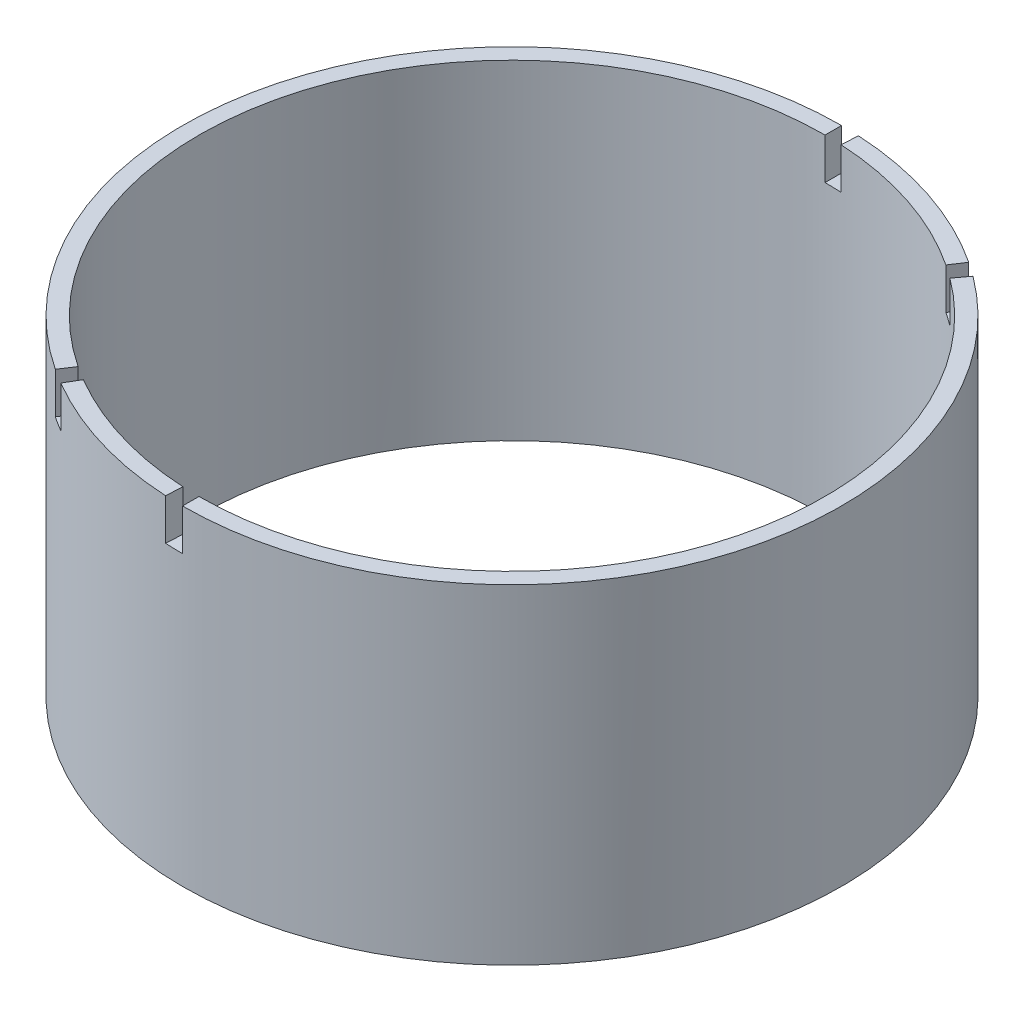
ISO-10303-21;
HEADER;
FILE_DESCRIPTION(('STEP AP214'),'2;1');
FILE_NAME('part.step','',(''),(''),'','','');
FILE_SCHEMA(('AUTOMOTIVE_DESIGN { 1 0 10303 214 1 1 1 1 }'));
ENDSEC;
DATA;
#1=APPLICATION_CONTEXT('core data for automotive mechanical design processes');
#2=APPLICATION_PROTOCOL_DEFINITION('international standard','automotive_design',2000,#1);
#3=PRODUCT_CONTEXT('',#1,'mechanical');
#4=PRODUCT('Part','Part','',(#3));
#5=PRODUCT_RELATED_PRODUCT_CATEGORY('part','',(#4));
#6=PRODUCT_DEFINITION_FORMATION('','',#4);
#7=PRODUCT_DEFINITION_CONTEXT('part definition',#1,'design');
#8=PRODUCT_DEFINITION('design','',#6,#7);
#9=PRODUCT_DEFINITION_SHAPE('','',#8);
#10=(LENGTH_UNIT() NAMED_UNIT(*) SI_UNIT(.MILLI.,.METRE.));
#11=(NAMED_UNIT(*) PLANE_ANGLE_UNIT() SI_UNIT($,.RADIAN.));
#12=(NAMED_UNIT(*) SI_UNIT($,.STERADIAN.) SOLID_ANGLE_UNIT());
#13=UNCERTAINTY_MEASURE_WITH_UNIT(LENGTH_MEASURE(1.E-05),#10,'distance_accuracy_value','');
#14=(GEOMETRIC_REPRESENTATION_CONTEXT(3) GLOBAL_UNCERTAINTY_ASSIGNED_CONTEXT((#13)) GLOBAL_UNIT_ASSIGNED_CONTEXT((#10,
#11,#12)) REPRESENTATION_CONTEXT('',''));
#15=CARTESIAN_POINT('',(0.,0.,0.));
#16=DIRECTION('',(0.,0.,1.));
#17=DIRECTION('',(1.,0.,0.));
#18=AXIS2_PLACEMENT_3D('',#15,#16,#17);
#19=CARTESIAN_POINT('',(0.,40.,0.));
#20=DIRECTION('',(0.,1.,0.));
#21=DIRECTION('',(0.,0.,1.));
#22=AXIS2_PLACEMENT_3D('',#19,#20,#21);
#23=PLANE('',#22);
#24=DIRECTION('',(-0.552402743706876,0.,0.833577356185445));
#25=VECTOR('',#24,1.);
#26=CARTESIAN_POINT('',(-22.096109748275,40.,33.3430942474178));
#27=LINE('',#26,#25);
#28=CARTESIAN_POINT('',(-20.9913042608613,40.,31.6759395350469));
#29=VERTEX_POINT('',#28);
#30=CARTESIAN_POINT('',(-22.096109748275,40.,33.3430942474178));
#31=VERTEX_POINT('',#30);
#32=EDGE_CURVE('E161',#29,#31,#27,.T.);
#33=ORIENTED_EDGE('',*,*,#32,.F.);
#34=CARTESIAN_POINT('',(0.,40.,0.));
#35=DIRECTION('',(0.,1.,0.));
#36=DIRECTION('',(0.,0.,1.));
#37=AXIS2_PLACEMENT_3D('',#34,#35,#36);
#38=CIRCLE('',#37,38.);
#39=CARTESIAN_POINT('',(0.,40.,-38.));
#40=VERTEX_POINT('',#39);
#41=EDGE_CURVE('E247',#40,#29,#38,.T.);
#42=ORIENTED_EDGE('',*,*,#41,.F.);
#43=DIRECTION('',(0.,0.,1.));
#44=VECTOR('',#43,1.);
#45=CARTESIAN_POINT('',(0.,40.,-40.));
#46=LINE('',#45,#44);
#47=CARTESIAN_POINT('',(0.,40.,-40.));
#48=VERTEX_POINT('',#47);
#49=EDGE_CURVE('E213',#48,#40,#46,.T.);
#50=ORIENTED_EDGE('',*,*,#49,.F.);
#51=CARTESIAN_POINT('',(0.,40.,0.));
#52=DIRECTION('',(0.,1.,0.));
#53=DIRECTION('',(0.,0.,1.));
#54=AXIS2_PLACEMENT_3D('',#51,#52,#53);
#55=CIRCLE('',#54,40.);
#56=EDGE_CURVE('E11',#48,#31,#55,.T.);
#57=ORIENTED_EDGE('',*,*,#56,.T.);
#58=EDGE_LOOP('',(#33,#42,#50,#57));
#59=FACE_BOUND('',#58,.T.);
#60=ADVANCED_FACE('F31',(#59),#23,.T.);
#61=DIRECTION('',(0.595494941447405,0.,-0.803359057153495));
#62=VECTOR('',#61,1.);
#63=CARTESIAN_POINT('',(23.8197976578962,40.,-32.1343622861398));
#64=LINE('',#63,#62);
#65=CARTESIAN_POINT('',(22.6288077750014,40.,-30.5276441718328));
#66=VERTEX_POINT('',#65);
#67=CARTESIAN_POINT('',(23.8197976578962,40.,-32.1343622861398));
#68=VERTEX_POINT('',#67);
#69=EDGE_CURVE('E174',#66,#68,#64,.T.);
#70=ORIENTED_EDGE('',*,*,#69,.F.);
#71=CARTESIAN_POINT('',(0.,40.,38.));
#72=VERTEX_POINT('',#71);
#73=EDGE_CURVE('E251',#72,#66,#38,.T.);
#74=ORIENTED_EDGE('',*,*,#73,.F.);
#75=DIRECTION('',(0.,0.,-1.));
#76=VECTOR('',#75,1.);
#77=CARTESIAN_POINT('',(0.,40.,40.));
#78=LINE('',#77,#76);
#79=CARTESIAN_POINT('',(0.,40.,40.));
#80=VERTEX_POINT('',#79);
#81=EDGE_CURVE('E189',#80,#72,#78,.T.);
#82=ORIENTED_EDGE('',*,*,#81,.F.);
#83=EDGE_CURVE('E41',#80,#68,#55,.T.);
#84=ORIENTED_EDGE('',*,*,#83,.T.);
#85=EDGE_LOOP('',(#70,#74,#82,#84));
#86=FACE_BOUND('',#85,.T.);
#87=ADVANCED_FACE('F291',(#86),#23,.T.);
#88=DIRECTION('',(0.50778034446023,0.,-0.861486576668406));
#89=VECTOR('',#88,1.);
#90=CARTESIAN_POINT('',(-20.3112137784094,40.,34.4594630667362));
#91=LINE('',#90,#89);
#92=CARTESIAN_POINT('',(-20.3112137784094,40.,34.4594630667362));
#93=VERTEX_POINT('',#92);
#94=CARTESIAN_POINT('',(-19.2956530894889,40.,32.7364899133993));
#95=VERTEX_POINT('',#94);
#96=EDGE_CURVE('E272',#93,#95,#91,.T.);
#97=ORIENTED_EDGE('',*,*,#96,.F.);
#98=CARTESIAN_POINT('',(-2.10526315789474,40.,39.9445599179164));
#99=VERTEX_POINT('',#98);
#100=EDGE_CURVE('E40',#93,#99,#55,.T.);
#101=ORIENTED_EDGE('',*,*,#100,.T.);
#102=DIRECTION('',(-0.0526315789473712,0.,0.998613997947909));
#103=VECTOR('',#102,1.);
#104=CARTESIAN_POINT('',(-2.10526315789474,40.,39.9445599179164));
#105=LINE('',#104,#103);
#106=CARTESIAN_POINT('',(-2.,40.,37.9473319220206));
#107=VERTEX_POINT('',#106);
#108=EDGE_CURVE('E200',#107,#99,#105,.T.);
#109=ORIENTED_EDGE('',*,*,#108,.F.);
#110=EDGE_CURVE('E250',#95,#107,#38,.T.);
#111=ORIENTED_EDGE('',*,*,#110,.F.);
#112=EDGE_LOOP('',(#97,#101,#109,#111));
#113=FACE_BOUND('',#112,.T.);
#114=ADVANCED_FACE('F271',(#113),#23,.T.);
#115=DIRECTION('',(-0.552402743706877,0.,0.833577356185444));
#116=VECTOR('',#115,1.);
#117=CARTESIAN_POINT('',(22.0961097482751,40.,-33.3430942474178));
#118=LINE('',#117,#116);
#119=CARTESIAN_POINT('',(22.0961097482751,40.,-33.3430942474178));
#120=VERTEX_POINT('',#119);
#121=CARTESIAN_POINT('',(20.9913042608613,40.,-31.6759395350469));
#122=VERTEX_POINT('',#121);
#123=EDGE_CURVE('E182',#120,#122,#118,.T.);
#124=ORIENTED_EDGE('',*,*,#123,.F.);
#125=CARTESIAN_POINT('',(2.10526315789473,40.,-39.9445599179164));
#126=VERTEX_POINT('',#125);
#127=EDGE_CURVE('E273',#120,#126,#55,.T.);
#128=ORIENTED_EDGE('',*,*,#127,.T.);
#129=DIRECTION('',(0.0526315789473683,0.,-0.998613997947909));
#130=VECTOR('',#129,1.);
#131=CARTESIAN_POINT('',(2.10526315789473,40.,-39.9445599179164));
#132=LINE('',#131,#130);
#133=CARTESIAN_POINT('',(2.,40.,-37.9473319220206));
#134=VERTEX_POINT('',#133);
#135=EDGE_CURVE('E225',#134,#126,#132,.T.);
#136=ORIENTED_EDGE('',*,*,#135,.F.);
#137=EDGE_CURVE('E253',#122,#134,#38,.T.);
#138=ORIENTED_EDGE('',*,*,#137,.F.);
#139=EDGE_LOOP('',(#124,#128,#136,#138));
#140=FACE_BOUND('',#139,.T.);
#141=ADVANCED_FACE('F284',(#140),#23,.T.);
#142=CARTESIAN_POINT('',(0.,0.,0.));
#143=DIRECTION('',(0.,1.,0.));
#144=DIRECTION('',(0.,0.,1.));
#145=AXIS2_PLACEMENT_3D('',#142,#143,#144);
#146=PLANE('',#145);
#147=CARTESIAN_POINT('',(0.,0.,0.));
#148=DIRECTION('',(0.,1.,0.));
#149=DIRECTION('',(0.,0.,1.));
#150=AXIS2_PLACEMENT_3D('',#147,#148,#149);
#151=CIRCLE('',#150,40.);
#152=CARTESIAN_POINT('',(0.,0.,40.));
#153=VERTEX_POINT('',#152);
#154=EDGE_CURVE('E35',#153,#153,#151,.T.);
#155=ORIENTED_EDGE('',*,*,#154,.F.);
#156=EDGE_LOOP('',(#155));
#157=FACE_BOUND('',#156,.T.);
#158=CARTESIAN_POINT('',(0.,0.,0.));
#159=DIRECTION('',(0.,1.,0.));
#160=DIRECTION('',(0.,0.,1.));
#161=AXIS2_PLACEMENT_3D('',#158,#159,#160);
#162=CIRCLE('',#161,38.);
#163=CARTESIAN_POINT('',(0.,0.,38.));
#164=VERTEX_POINT('',#163);
#165=EDGE_CURVE('E239',#164,#164,#162,.T.);
#166=ORIENTED_EDGE('',*,*,#165,.T.);
#167=EDGE_LOOP('',(#166));
#168=FACE_BOUND('',#167,.T.);
#169=ADVANCED_FACE('F282',(#157,#168),#146,.F.);
#170=CARTESIAN_POINT('',(0.,40.,0.));
#171=DIRECTION('',(0.,-1.,0.));
#172=DIRECTION('',(0.,0.,-1.));
#173=AXIS2_PLACEMENT_3D('',#170,#171,#172);
#174=CYLINDRICAL_SURFACE('',#173,40.);
#175=CARTESIAN_POINT('',(0.,35.,0.));
#176=DIRECTION('',(0.,1.,0.));
#177=DIRECTION('',(0.,0.,-1.));
#178=AXIS2_PLACEMENT_3D('',#175,#176,#177);
#179=CIRCLE('',#178,40.);
#180=CARTESIAN_POINT('',(-22.096109748275,35.,33.3430942474178));
#181=VERTEX_POINT('',#180);
#182=CARTESIAN_POINT('',(-20.3112137784094,35.,34.4594630667362));
#183=VERTEX_POINT('',#182);
#184=EDGE_CURVE('E152',#181,#183,#179,.T.);
#185=ORIENTED_EDGE('',*,*,#184,.F.);
#186=DIRECTION('',(0.,1.,0.));
#187=VECTOR('',#186,1.);
#188=CARTESIAN_POINT('',(-22.096109748275,35.,33.3430942474178));
#189=LINE('',#188,#187);
#190=EDGE_CURVE('E184',#181,#31,#189,.T.);
#191=ORIENTED_EDGE('',*,*,#190,.T.);
#192=ORIENTED_EDGE('',*,*,#56,.F.);
#193=DIRECTION('',(0.,1.,0.));
#194=VECTOR('',#193,1.);
#195=CARTESIAN_POINT('',(0.,35.,-40.));
#196=LINE('',#195,#194);
#197=CARTESIAN_POINT('',(0.,35.,-40.));
#198=VERTEX_POINT('',#197);
#199=EDGE_CURVE('E232',#198,#48,#196,.T.);
#200=ORIENTED_EDGE('',*,*,#199,.F.);
#201=CARTESIAN_POINT('',(0.,35.,0.));
#202=DIRECTION('',(0.,1.,0.));
#203=DIRECTION('',(0.,0.,-1.));
#204=AXIS2_PLACEMENT_3D('',#201,#202,#203);
#205=CIRCLE('',#204,40.);
#206=CARTESIAN_POINT('',(2.10526315789473,35.,-39.9445599179164));
#207=VERTEX_POINT('',#206);
#208=EDGE_CURVE('E221',#207,#198,#205,.T.);
#209=ORIENTED_EDGE('',*,*,#208,.F.);
#210=DIRECTION('',(0.,1.,0.));
#211=VECTOR('',#210,1.);
#212=CARTESIAN_POINT('',(2.10526315789473,35.,-39.9445599179164));
#213=LINE('',#212,#211);
#214=EDGE_CURVE('E236',#207,#126,#213,.T.);
#215=ORIENTED_EDGE('',*,*,#214,.T.);
#216=ORIENTED_EDGE('',*,*,#127,.F.);
#217=DIRECTION('',(0.,1.,0.));
#218=VECTOR('',#217,1.);
#219=CARTESIAN_POINT('',(22.0961097482751,35.,-33.3430942474178));
#220=LINE('',#219,#218);
#221=CARTESIAN_POINT('',(22.0961097482751,35.,-33.3430942474178));
#222=VERTEX_POINT('',#221);
#223=EDGE_CURVE('E181',#222,#120,#220,.T.);
#224=ORIENTED_EDGE('',*,*,#223,.F.);
#225=CARTESIAN_POINT('',(0.,35.,0.));
#226=DIRECTION('',(0.,1.,0.));
#227=DIRECTION('',(0.,0.,-1.));
#228=AXIS2_PLACEMENT_3D('',#225,#226,#227);
#229=CIRCLE('',#228,40.);
#230=CARTESIAN_POINT('',(23.8197976578962,35.,-32.1343622861398));
#231=VERTEX_POINT('',#230);
#232=EDGE_CURVE('E172',#231,#222,#229,.T.);
#233=ORIENTED_EDGE('',*,*,#232,.F.);
#234=DIRECTION('',(0.,1.,0.));
#235=VECTOR('',#234,1.);
#236=CARTESIAN_POINT('',(23.8197976578962,35.,-32.1343622861398));
#237=LINE('',#236,#235);
#238=EDGE_CURVE('E186',#231,#68,#237,.T.);
#239=ORIENTED_EDGE('',*,*,#238,.T.);
#240=ORIENTED_EDGE('',*,*,#83,.F.);
#241=DIRECTION('',(0.,1.,0.));
#242=VECTOR('',#241,1.);
#243=CARTESIAN_POINT('',(0.,35.,40.));
#244=LINE('',#243,#242);
#245=CARTESIAN_POINT('',(0.,35.,40.));
#246=VERTEX_POINT('',#245);
#247=EDGE_CURVE('E207',#246,#80,#244,.T.);
#248=ORIENTED_EDGE('',*,*,#247,.F.);
#249=CARTESIAN_POINT('',(0.,35.,0.));
#250=DIRECTION('',(0.,1.,0.));
#251=DIRECTION('',(0.,0.,1.));
#252=AXIS2_PLACEMENT_3D('',#249,#250,#251);
#253=CIRCLE('',#252,40.);
#254=CARTESIAN_POINT('',(-2.10526315789474,35.,39.9445599179164));
#255=VERTEX_POINT('',#254);
#256=EDGE_CURVE('E196',#255,#246,#253,.T.);
#257=ORIENTED_EDGE('',*,*,#256,.F.);
#258=DIRECTION('',(0.,1.,0.));
#259=VECTOR('',#258,1.);
#260=CARTESIAN_POINT('',(-2.10526315789474,35.,39.9445599179164));
#261=LINE('',#260,#259);
#262=EDGE_CURVE('E211',#255,#99,#261,.T.);
#263=ORIENTED_EDGE('',*,*,#262,.T.);
#264=ORIENTED_EDGE('',*,*,#100,.F.);
#265=DIRECTION('',(0.,1.,0.));
#266=VECTOR('',#265,1.);
#267=CARTESIAN_POINT('',(-20.3112137784094,35.,34.4594630667362));
#268=LINE('',#267,#266);
#269=EDGE_CURVE('E146',#183,#93,#268,.T.);
#270=ORIENTED_EDGE('',*,*,#269,.F.);
#271=EDGE_LOOP('',(#185,#191,#192,#200,#209,#215,#216,#224,#233,#239,#240,#248,#257,#263,#264,#270));
#272=FACE_BOUND('',#271,.T.);
#273=ORIENTED_EDGE('',*,*,#154,.T.);
#274=EDGE_LOOP('',(#273));
#275=FACE_BOUND('',#274,.T.);
#276=ADVANCED_FACE('F33',(#272,#275),#174,.T.);
#277=CARTESIAN_POINT('',(0.,40.,0.));
#278=DIRECTION('',(0.,-1.,0.));
#279=DIRECTION('',(0.,0.,-1.));
#280=AXIS2_PLACEMENT_3D('',#277,#278,#279);
#281=CYLINDRICAL_SURFACE('',#280,38.);
#282=DIRECTION('',(0.,1.,0.));
#283=VECTOR('',#282,1.);
#284=CARTESIAN_POINT('',(-20.9913042608613,35.,31.6759395350469));
#285=LINE('',#284,#283);
#286=CARTESIAN_POINT('',(-20.9913042608613,35.,31.6759395350469));
#287=VERTEX_POINT('',#286);
#288=EDGE_CURVE('E167',#287,#29,#285,.T.);
#289=ORIENTED_EDGE('',*,*,#288,.F.);
#290=CARTESIAN_POINT('',(0.,35.,0.));
#291=DIRECTION('',(0.,-1.,0.));
#292=DIRECTION('',(0.,0.,-1.));
#293=AXIS2_PLACEMENT_3D('',#290,#291,#292);
#294=CIRCLE('',#293,38.);
#295=CARTESIAN_POINT('',(-19.2956530894889,35.,32.7364899133993));
#296=VERTEX_POINT('',#295);
#297=EDGE_CURVE('E151',#296,#287,#294,.T.);
#298=ORIENTED_EDGE('',*,*,#297,.F.);
#299=DIRECTION('',(0.,1.,0.));
#300=VECTOR('',#299,1.);
#301=CARTESIAN_POINT('',(-19.2956530894889,35.,32.7364899133993));
#302=LINE('',#301,#300);
#303=EDGE_CURVE('E149',#296,#95,#302,.T.);
#304=ORIENTED_EDGE('',*,*,#303,.T.);
#305=ORIENTED_EDGE('',*,*,#110,.T.);
#306=DIRECTION('',(0.,1.,0.));
#307=VECTOR('',#306,1.);
#308=CARTESIAN_POINT('',(-2.,35.,37.9473319220206));
#309=LINE('',#308,#307);
#310=CARTESIAN_POINT('',(-2.,35.,37.9473319220206));
#311=VERTEX_POINT('',#310);
#312=EDGE_CURVE('E214',#311,#107,#309,.T.);
#313=ORIENTED_EDGE('',*,*,#312,.F.);
#314=CARTESIAN_POINT('',(0.,35.,0.));
#315=DIRECTION('',(0.,-1.,0.));
#316=DIRECTION('',(0.,0.,1.));
#317=AXIS2_PLACEMENT_3D('',#314,#315,#316);
#318=CIRCLE('',#317,38.);
#319=CARTESIAN_POINT('',(0.,35.,38.));
#320=VERTEX_POINT('',#319);
#321=EDGE_CURVE('E202',#320,#311,#318,.T.);
#322=ORIENTED_EDGE('',*,*,#321,.F.);
#323=DIRECTION('',(0.,1.,0.));
#324=VECTOR('',#323,1.);
#325=CARTESIAN_POINT('',(0.,35.,38.));
#326=LINE('',#325,#324);
#327=EDGE_CURVE('E217',#320,#72,#326,.T.);
#328=ORIENTED_EDGE('',*,*,#327,.T.);
#329=ORIENTED_EDGE('',*,*,#73,.T.);
#330=DIRECTION('',(0.,1.,0.));
#331=VECTOR('',#330,1.);
#332=CARTESIAN_POINT('',(22.6288077750014,35.,-30.5276441718328));
#333=LINE('',#332,#331);
#334=CARTESIAN_POINT('',(22.6288077750014,35.,-30.5276441718328));
#335=VERTEX_POINT('',#334);
#336=EDGE_CURVE('E190',#335,#66,#333,.T.);
#337=ORIENTED_EDGE('',*,*,#336,.F.);
#338=CARTESIAN_POINT('',(0.,35.,0.));
#339=DIRECTION('',(0.,-1.,0.));
#340=DIRECTION('',(0.,0.,-1.));
#341=AXIS2_PLACEMENT_3D('',#338,#339,#340);
#342=CIRCLE('',#341,38.);
#343=CARTESIAN_POINT('',(20.9913042608613,35.,-31.6759395350469));
#344=VERTEX_POINT('',#343);
#345=EDGE_CURVE('E176',#344,#335,#342,.T.);
#346=ORIENTED_EDGE('',*,*,#345,.F.);
#347=DIRECTION('',(0.,1.,0.));
#348=VECTOR('',#347,1.);
#349=CARTESIAN_POINT('',(20.9913042608613,35.,-31.6759395350469));
#350=LINE('',#349,#348);
#351=EDGE_CURVE('E192',#344,#122,#350,.T.);
#352=ORIENTED_EDGE('',*,*,#351,.T.);
#353=ORIENTED_EDGE('',*,*,#137,.T.);
#354=DIRECTION('',(0.,1.,0.));
#355=VECTOR('',#354,1.);
#356=CARTESIAN_POINT('',(2.,35.,-37.9473319220206));
#357=LINE('',#356,#355);
#358=CARTESIAN_POINT('',(2.,35.,-37.9473319220206));
#359=VERTEX_POINT('',#358);
#360=EDGE_CURVE('E240',#359,#134,#357,.T.);
#361=ORIENTED_EDGE('',*,*,#360,.F.);
#362=CARTESIAN_POINT('',(0.,35.,0.));
#363=DIRECTION('',(0.,-1.,0.));
#364=DIRECTION('',(0.,0.,-1.));
#365=AXIS2_PLACEMENT_3D('',#362,#363,#364);
#366=CIRCLE('',#365,38.);
#367=CARTESIAN_POINT('',(0.,35.,-38.));
#368=VERTEX_POINT('',#367);
#369=EDGE_CURVE('E227',#368,#359,#366,.T.);
#370=ORIENTED_EDGE('',*,*,#369,.F.);
#371=DIRECTION('',(0.,1.,0.));
#372=VECTOR('',#371,1.);
#373=CARTESIAN_POINT('',(0.,35.,-38.));
#374=LINE('',#373,#372);
#375=EDGE_CURVE('E243',#368,#40,#374,.T.);
#376=ORIENTED_EDGE('',*,*,#375,.T.);
#377=ORIENTED_EDGE('',*,*,#41,.T.);
#378=EDGE_LOOP('',(#289,#298,#304,#305,#313,#322,#328,#329,#337,#346,#352,#353,#361,#370,#376,#377));
#379=FACE_BOUND('',#378,.T.);
#380=ORIENTED_EDGE('',*,*,#165,.F.);
#381=EDGE_LOOP('',(#380));
#382=FACE_BOUND('',#381,.T.);
#383=ADVANCED_FACE('F263',(#379,#382),#281,.F.);
#384=CARTESIAN_POINT('',(2.10526315789473,35.,-39.9445599179164));
#385=DIRECTION('',(0.998613997947909,0.,0.0526315789473683));
#386=DIRECTION('',(0.0526315789473683,0.,-0.998613997947909));
#387=AXIS2_PLACEMENT_3D('',#384,#385,#386);
#388=PLANE('',#387);
#389=ORIENTED_EDGE('',*,*,#135,.T.);
#390=ORIENTED_EDGE('',*,*,#214,.F.);
#391=DIRECTION('',(0.0526315789473683,0.,-0.998613997947909));
#392=VECTOR('',#391,1.);
#393=CARTESIAN_POINT('',(2.10526315789473,35.,-39.9445599179164));
#394=LINE('',#393,#392);
#395=EDGE_CURVE('E229',#359,#207,#394,.T.);
#396=ORIENTED_EDGE('',*,*,#395,.F.);
#397=ORIENTED_EDGE('',*,*,#360,.T.);
#398=EDGE_LOOP('',(#389,#390,#396,#397));
#399=FACE_BOUND('',#398,.T.);
#400=ADVANCED_FACE('F301',(#399),#388,.F.);
#401=CARTESIAN_POINT('',(0.,35.,-40.));
#402=DIRECTION('',(-1.,0.,0.));
#403=DIRECTION('',(0.,0.,1.));
#404=AXIS2_PLACEMENT_3D('',#401,#402,#403);
#405=PLANE('',#404);
#406=ORIENTED_EDGE('',*,*,#49,.T.);
#407=ORIENTED_EDGE('',*,*,#375,.F.);
#408=DIRECTION('',(0.,0.,1.));
#409=VECTOR('',#408,1.);
#410=CARTESIAN_POINT('',(0.,35.,-40.));
#411=LINE('',#410,#409);
#412=EDGE_CURVE('E224',#198,#368,#411,.T.);
#413=ORIENTED_EDGE('',*,*,#412,.F.);
#414=ORIENTED_EDGE('',*,*,#199,.T.);
#415=EDGE_LOOP('',(#406,#407,#413,#414));
#416=FACE_BOUND('',#415,.T.);
#417=ADVANCED_FACE('F302',(#416),#405,.F.);
#418=CARTESIAN_POINT('',(0.,35.,0.));
#419=DIRECTION('',(0.,-1.,0.));
#420=DIRECTION('',(0.,0.,-1.));
#421=AXIS2_PLACEMENT_3D('',#418,#419,#420);
#422=PLANE('',#421);
#423=ORIENTED_EDGE('',*,*,#208,.T.);
#424=ORIENTED_EDGE('',*,*,#412,.T.);
#425=ORIENTED_EDGE('',*,*,#369,.T.);
#426=ORIENTED_EDGE('',*,*,#395,.T.);
#427=EDGE_LOOP('',(#423,#424,#425,#426));
#428=FACE_BOUND('',#427,.T.);
#429=ADVANCED_FACE('F305',(#428),#422,.F.);
#430=CARTESIAN_POINT('',(-2.10526315789474,35.,39.9445599179164));
#431=DIRECTION('',(-0.998613997947909,0.,-0.0526315789473712));
#432=DIRECTION('',(-0.0526315789473712,0.,0.998613997947909));
#433=AXIS2_PLACEMENT_3D('',#430,#431,#432);
#434=PLANE('',#433);
#435=ORIENTED_EDGE('',*,*,#108,.T.);
#436=ORIENTED_EDGE('',*,*,#262,.F.);
#437=DIRECTION('',(-0.0526315789473712,0.,0.998613997947909));
#438=VECTOR('',#437,1.);
#439=CARTESIAN_POINT('',(-2.10526315789474,35.,39.9445599179164));
#440=LINE('',#439,#438);
#441=EDGE_CURVE('E204',#311,#255,#440,.T.);
#442=ORIENTED_EDGE('',*,*,#441,.F.);
#443=ORIENTED_EDGE('',*,*,#312,.T.);
#444=EDGE_LOOP('',(#435,#436,#442,#443));
#445=FACE_BOUND('',#444,.T.);
#446=ADVANCED_FACE('F270',(#445),#434,.F.);
#447=CARTESIAN_POINT('',(0.,35.,40.));
#448=DIRECTION('',(1.,0.,0.));
#449=DIRECTION('',(0.,0.,-1.));
#450=AXIS2_PLACEMENT_3D('',#447,#448,#449);
#451=PLANE('',#450);
#452=ORIENTED_EDGE('',*,*,#81,.T.);
#453=ORIENTED_EDGE('',*,*,#327,.F.);
#454=DIRECTION('',(0.,0.,-1.));
#455=VECTOR('',#454,1.);
#456=CARTESIAN_POINT('',(0.,35.,40.));
#457=LINE('',#456,#455);
#458=EDGE_CURVE('E199',#246,#320,#457,.T.);
#459=ORIENTED_EDGE('',*,*,#458,.F.);
#460=ORIENTED_EDGE('',*,*,#247,.T.);
#461=EDGE_LOOP('',(#452,#453,#459,#460));
#462=FACE_BOUND('',#461,.T.);
#463=ADVANCED_FACE('F313',(#462),#451,.F.);
#464=CARTESIAN_POINT('',(0.,35.,0.));
#465=DIRECTION('',(0.,1.,0.));
#466=DIRECTION('',(0.,0.,1.));
#467=AXIS2_PLACEMENT_3D('',#464,#465,#466);
#468=PLANE('',#467);
#469=ORIENTED_EDGE('',*,*,#256,.T.);
#470=ORIENTED_EDGE('',*,*,#458,.T.);
#471=ORIENTED_EDGE('',*,*,#321,.T.);
#472=ORIENTED_EDGE('',*,*,#441,.T.);
#473=EDGE_LOOP('',(#469,#470,#471,#472));
#474=FACE_BOUND('',#473,.T.);
#475=ADVANCED_FACE('F316',(#474),#468,.T.);
#476=CARTESIAN_POINT('',(23.8197976578962,35.,-32.1343622861398));
#477=DIRECTION('',(0.803359057153495,0.,0.595494941447405));
#478=DIRECTION('',(0.595494941447405,0.,-0.803359057153495));
#479=AXIS2_PLACEMENT_3D('',#476,#477,#478);
#480=PLANE('',#479);
#481=ORIENTED_EDGE('',*,*,#69,.T.);
#482=ORIENTED_EDGE('',*,*,#238,.F.);
#483=DIRECTION('',(0.595494941447405,0.,-0.803359057153495));
#484=VECTOR('',#483,1.);
#485=CARTESIAN_POINT('',(23.8197976578962,35.,-32.1343622861398));
#486=LINE('',#485,#484);
#487=EDGE_CURVE('E178',#335,#231,#486,.T.);
#488=ORIENTED_EDGE('',*,*,#487,.F.);
#489=ORIENTED_EDGE('',*,*,#336,.T.);
#490=EDGE_LOOP('',(#481,#482,#488,#489));
#491=FACE_BOUND('',#490,.T.);
#492=ADVANCED_FACE('F322',(#491),#480,.F.);
#493=CARTESIAN_POINT('',(22.0961097482751,35.,-33.3430942474178));
#494=DIRECTION('',(-0.833577356185444,0.,-0.552402743706877));
#495=DIRECTION('',(-0.552402743706877,0.,0.833577356185444));
#496=AXIS2_PLACEMENT_3D('',#493,#494,#495);
#497=PLANE('',#496);
#498=ORIENTED_EDGE('',*,*,#123,.T.);
#499=ORIENTED_EDGE('',*,*,#351,.F.);
#500=DIRECTION('',(-0.552402743706877,0.,0.833577356185444));
#501=VECTOR('',#500,1.);
#502=CARTESIAN_POINT('',(22.0961097482751,35.,-33.3430942474178));
#503=LINE('',#502,#501);
#504=EDGE_CURVE('E56',#222,#344,#503,.T.);
#505=ORIENTED_EDGE('',*,*,#504,.F.);
#506=ORIENTED_EDGE('',*,*,#223,.T.);
#507=EDGE_LOOP('',(#498,#499,#505,#506));
#508=FACE_BOUND('',#507,.T.);
#509=ADVANCED_FACE('F324',(#508),#497,.F.);
#510=CARTESIAN_POINT('',(0.,35.,0.));
#511=DIRECTION('',(0.,-1.,0.));
#512=DIRECTION('',(0.,0.,-1.));
#513=AXIS2_PLACEMENT_3D('',#510,#511,#512);
#514=PLANE('',#513);
#515=ORIENTED_EDGE('',*,*,#232,.T.);
#516=ORIENTED_EDGE('',*,*,#504,.T.);
#517=ORIENTED_EDGE('',*,*,#345,.T.);
#518=ORIENTED_EDGE('',*,*,#487,.T.);
#519=EDGE_LOOP('',(#515,#516,#517,#518));
#520=FACE_BOUND('',#519,.T.);
#521=ADVANCED_FACE('F327',(#520),#514,.F.);
#522=CARTESIAN_POINT('',(-22.096109748275,35.,33.3430942474178));
#523=DIRECTION('',(-0.833577356185445,0.,-0.552402743706876));
#524=DIRECTION('',(-0.552402743706876,0.,0.833577356185445));
#525=AXIS2_PLACEMENT_3D('',#522,#523,#524);
#526=PLANE('',#525);
#527=ORIENTED_EDGE('',*,*,#32,.T.);
#528=ORIENTED_EDGE('',*,*,#190,.F.);
#529=DIRECTION('',(-0.552402743706876,0.,0.833577356185445));
#530=VECTOR('',#529,1.);
#531=CARTESIAN_POINT('',(-22.096109748275,35.,33.3430942474178));
#532=LINE('',#531,#530);
#533=EDGE_CURVE('E158',#287,#181,#532,.T.);
#534=ORIENTED_EDGE('',*,*,#533,.F.);
#535=ORIENTED_EDGE('',*,*,#288,.T.);
#536=EDGE_LOOP('',(#527,#528,#534,#535));
#537=FACE_BOUND('',#536,.T.);
#538=ADVANCED_FACE('F334',(#537),#526,.F.);
#539=CARTESIAN_POINT('',(-20.3112137784094,35.,34.4594630667362));
#540=DIRECTION('',(0.861486576668406,0.,0.50778034446023));
#541=DIRECTION('',(0.50778034446023,0.,-0.861486576668406));
#542=AXIS2_PLACEMENT_3D('',#539,#540,#541);
#543=PLANE('',#542);
#544=ORIENTED_EDGE('',*,*,#96,.T.);
#545=ORIENTED_EDGE('',*,*,#303,.F.);
#546=DIRECTION('',(0.50778034446023,0.,-0.861486576668406));
#547=VECTOR('',#546,1.);
#548=CARTESIAN_POINT('',(-20.3112137784094,35.,34.4594630667362));
#549=LINE('',#548,#547);
#550=EDGE_CURVE('E48',#183,#296,#549,.T.);
#551=ORIENTED_EDGE('',*,*,#550,.F.);
#552=ORIENTED_EDGE('',*,*,#269,.T.);
#553=EDGE_LOOP('',(#544,#545,#551,#552));
#554=FACE_BOUND('',#553,.T.);
#555=ADVANCED_FACE('F144',(#554),#543,.F.);
#556=CARTESIAN_POINT('',(0.,35.,0.));
#557=DIRECTION('',(0.,-1.,0.));
#558=DIRECTION('',(0.,0.,-1.));
#559=AXIS2_PLACEMENT_3D('',#556,#557,#558);
#560=PLANE('',#559);
#561=ORIENTED_EDGE('',*,*,#184,.T.);
#562=ORIENTED_EDGE('',*,*,#550,.T.);
#563=ORIENTED_EDGE('',*,*,#297,.T.);
#564=ORIENTED_EDGE('',*,*,#533,.T.);
#565=EDGE_LOOP('',(#561,#562,#563,#564));
#566=FACE_BOUND('',#565,.T.);
#567=ADVANCED_FACE('F156',(#566),#560,.F.);
#568=CLOSED_SHELL('',(#60,#87,#114,#141,#169,#276,#383,#400,#417,#429,#446,#463,#475,#492,#509,
#521,#538,#555,#567));
#569=MANIFOLD_SOLID_BREP('B2',#568);
#570=ADVANCED_BREP_SHAPE_REPRESENTATION('',(#18,#569),#14);
#571=SHAPE_DEFINITION_REPRESENTATION(#9,#570);
ENDSEC;
END-ISO-10303-21;
